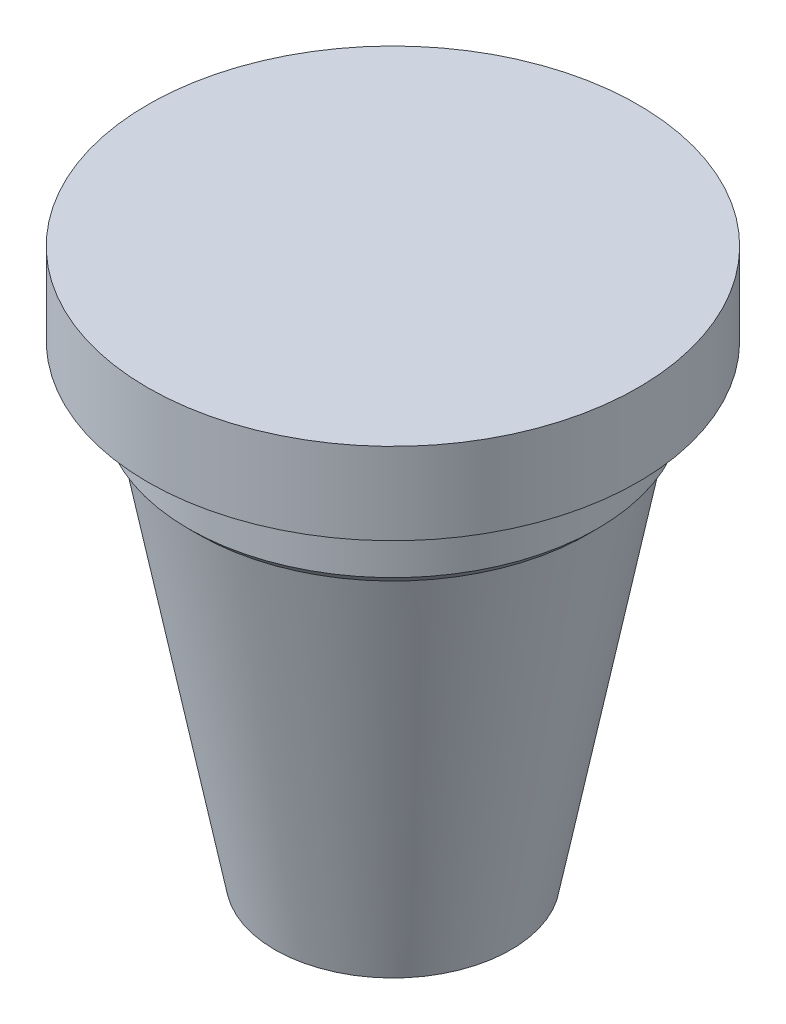
ISO-10303-21;
HEADER;
FILE_DESCRIPTION(('STEP AP214'),'2;1');
FILE_NAME('part.step','',(''),(''),'','','');
FILE_SCHEMA(('AUTOMOTIVE_DESIGN { 1 0 10303 214 1 1 1 1 }'));
ENDSEC;
DATA;
#1=APPLICATION_CONTEXT('core data for automotive mechanical design processes');
#2=APPLICATION_PROTOCOL_DEFINITION('international standard','automotive_design',2000,#1);
#3=PRODUCT_CONTEXT('',#1,'mechanical');
#4=PRODUCT('Part','Part','',(#3));
#5=PRODUCT_RELATED_PRODUCT_CATEGORY('part','',(#4));
#6=PRODUCT_DEFINITION_FORMATION('','',#4);
#7=PRODUCT_DEFINITION_CONTEXT('part definition',#1,'design');
#8=PRODUCT_DEFINITION('design','',#6,#7);
#9=PRODUCT_DEFINITION_SHAPE('','',#8);
#10=(LENGTH_UNIT() NAMED_UNIT(*) SI_UNIT(.MILLI.,.METRE.));
#11=(NAMED_UNIT(*) PLANE_ANGLE_UNIT() SI_UNIT($,.RADIAN.));
#12=(NAMED_UNIT(*) SI_UNIT($,.STERADIAN.) SOLID_ANGLE_UNIT());
#13=UNCERTAINTY_MEASURE_WITH_UNIT(LENGTH_MEASURE(1.E-05),#10,'distance_accuracy_value','');
#14=(GEOMETRIC_REPRESENTATION_CONTEXT(3) GLOBAL_UNCERTAINTY_ASSIGNED_CONTEXT((#13)) GLOBAL_UNIT_ASSIGNED_CONTEXT((#10,
#11,#12)) REPRESENTATION_CONTEXT('',''));
#15=CARTESIAN_POINT('',(0.,0.,0.));
#16=DIRECTION('',(0.,0.,1.));
#17=DIRECTION('',(1.,0.,0.));
#18=AXIS2_PLACEMENT_3D('',#15,#16,#17);
#19=CARTESIAN_POINT('',(0.,2.,0.));
#20=DIRECTION('',(0.,-1.,0.));
#21=DIRECTION('',(0.,0.,-1.));
#22=AXIS2_PLACEMENT_3D('',#19,#20,#21);
#23=PLANE('',#22);
#24=CARTESIAN_POINT('',(0.,2.,0.));
#25=DIRECTION('',(0.,-1.,0.));
#26=DIRECTION('',(0.,0.,-1.));
#27=AXIS2_PLACEMENT_3D('',#24,#25,#26);
#28=CIRCLE('',#27,21.6668554158657);
#29=CARTESIAN_POINT('',(0.,2.,-21.6668554158657));
#30=VERTEX_POINT('',#29);
#31=EDGE_CURVE('E55',#30,#30,#28,.T.);
#32=ORIENTED_EDGE('',*,*,#31,.T.);
#33=EDGE_LOOP('',(#32));
#34=FACE_BOUND('',#33,.T.);
#35=ADVANCED_FACE('F41',(#34),#23,.T.);
#36=CARTESIAN_POINT('',(0.,0.376395142507585,0.));
#37=DIRECTION('',(0.,1.,0.));
#38=DIRECTION('',(0.,0.,1.));
#39=AXIS2_PLACEMENT_3D('',#36,#37,#38);
#40=CONICAL_SURFACE('',#39,21.3557376202002,0.189326600712665);
#41=CARTESIAN_POINT('',(0.,74.9797878302453,0.));
#42=DIRECTION('',(0.,-1.,0.));
#43=DIRECTION('',(0.,0.,-1.));
#44=AXIS2_PLACEMENT_3D('',#41,#42,#43);
#45=CIRCLE('',#44,35.6513607054993);
#46=CARTESIAN_POINT('',(0.,74.9797878302453,-35.6513607054993));
#47=VERTEX_POINT('',#46);
#48=EDGE_CURVE('E49',#47,#47,#45,.T.);
#49=ORIENTED_EDGE('',*,*,#48,.T.);
#50=EDGE_LOOP('',(#49));
#51=FACE_BOUND('',#50,.T.);
#52=ORIENTED_EDGE('',*,*,#31,.F.);
#53=EDGE_LOOP('',(#52));
#54=FACE_BOUND('',#53,.T.);
#55=ADVANCED_FACE('F90',(#51,#54),#40,.T.);
#56=CARTESIAN_POINT('',(0.,75.4142135623731,0.));
#57=DIRECTION('',(0.,1.,0.));
#58=DIRECTION('',(0.,0.,1.));
#59=AXIS2_PLACEMENT_3D('',#56,#57,#58);
#60=CONICAL_SURFACE('',#59,36.0857864376271,0.785398163397447);
#61=CARTESIAN_POINT('',(0.,76.8284271247461,0.));
#62=DIRECTION('',(0.,1.,0.));
#63=DIRECTION('',(0.,0.,1.));
#64=AXIS2_PLACEMENT_3D('',#61,#62,#63);
#65=CIRCLE('',#64,37.5000000000001);
#66=CARTESIAN_POINT('',(0.,76.8284271247461,37.5000000000001));
#67=VERTEX_POINT('',#66);
#68=EDGE_CURVE('E10',#67,#67,#65,.F.);
#69=ORIENTED_EDGE('',*,*,#68,.T.);
#70=EDGE_LOOP('',(#69));
#71=FACE_BOUND('',#70,.T.);
#72=ORIENTED_EDGE('',*,*,#48,.F.);
#73=EDGE_LOOP('',(#72));
#74=FACE_BOUND('',#73,.T.);
#75=ADVANCED_FACE('F97',(#71,#74),#60,.T.);
#76=CARTESIAN_POINT('',(0.,0.,0.));
#77=DIRECTION('',(0.,-1.,0.));
#78=DIRECTION('',(0.,0.,-1.));
#79=AXIS2_PLACEMENT_3D('',#76,#77,#78);
#80=CYLINDRICAL_SURFACE('',#79,37.5000000000001);
#81=ORIENTED_EDGE('',*,*,#68,.F.);
#82=EDGE_LOOP('',(#81));
#83=FACE_BOUND('',#82,.T.);
#84=CARTESIAN_POINT('',(0.,88.,0.));
#85=DIRECTION('',(0.,-1.,0.));
#86=DIRECTION('',(0.,0.,-1.));
#87=AXIS2_PLACEMENT_3D('',#84,#85,#86);
#88=CIRCLE('',#87,37.5000000000001);
#89=CARTESIAN_POINT('',(0.,88.,-37.5000000000001));
#90=VERTEX_POINT('',#89);
#91=EDGE_CURVE('E44',#90,#90,#88,.T.);
#92=ORIENTED_EDGE('',*,*,#91,.T.);
#93=EDGE_LOOP('',(#92));
#94=FACE_BOUND('',#93,.T.);
#95=ADVANCED_FACE('F102',(#83,#94),#80,.T.);
#96=CARTESIAN_POINT('',(0.,103.,0.));
#97=DIRECTION('',(0.,-1.,0.));
#98=DIRECTION('',(0.,0.,-1.));
#99=AXIS2_PLACEMENT_3D('',#96,#97,#98);
#100=CYLINDRICAL_SURFACE('',#99,45.);
#101=CARTESIAN_POINT('',(0.,103.,0.));
#102=DIRECTION('',(0.,1.,0.));
#103=DIRECTION('',(0.,0.,1.));
#104=AXIS2_PLACEMENT_3D('',#101,#102,#103);
#105=CIRCLE('',#104,45.);
#106=CARTESIAN_POINT('',(0.,103.,45.));
#107=VERTEX_POINT('',#106);
#108=EDGE_CURVE('E66',#107,#107,#105,.T.);
#109=ORIENTED_EDGE('',*,*,#108,.F.);
#110=EDGE_LOOP('',(#109));
#111=FACE_BOUND('',#110,.T.);
#112=CARTESIAN_POINT('',(0.,88.,0.));
#113=DIRECTION('',(0.,1.,0.));
#114=DIRECTION('',(0.,0.,1.));
#115=AXIS2_PLACEMENT_3D('',#112,#113,#114);
#116=CIRCLE('',#115,45.);
#117=CARTESIAN_POINT('',(0.,88.,45.));
#118=VERTEX_POINT('',#117);
#119=EDGE_CURVE('E58',#118,#118,#116,.T.);
#120=ORIENTED_EDGE('',*,*,#119,.T.);
#121=EDGE_LOOP('',(#120));
#122=FACE_BOUND('',#121,.T.);
#123=ADVANCED_FACE('F77',(#111,#122),#100,.T.);
#124=CARTESIAN_POINT('',(0.,103.,0.));
#125=DIRECTION('',(0.,1.,0.));
#126=DIRECTION('',(0.,0.,1.));
#127=AXIS2_PLACEMENT_3D('',#124,#125,#126);
#128=PLANE('',#127);
#129=ORIENTED_EDGE('',*,*,#108,.T.);
#130=EDGE_LOOP('',(#129));
#131=FACE_BOUND('',#130,.T.);
#132=ADVANCED_FACE('F81',(#131),#128,.T.);
#133=CARTESIAN_POINT('',(0.,88.,0.));
#134=DIRECTION('',(0.,1.,0.));
#135=DIRECTION('',(0.,0.,1.));
#136=AXIS2_PLACEMENT_3D('',#133,#134,#135);
#137=PLANE('',#136);
#138=ORIENTED_EDGE('',*,*,#91,.F.);
#139=EDGE_LOOP('',(#138));
#140=FACE_BOUND('',#139,.T.);
#141=ORIENTED_EDGE('',*,*,#119,.F.);
#142=EDGE_LOOP('',(#141));
#143=FACE_BOUND('',#142,.T.);
#144=ADVANCED_FACE('F79',(#140,#143),#137,.F.);
#145=CLOSED_SHELL('',(#35,#55,#75,#95,#123,#132,#144));
#146=MANIFOLD_SOLID_BREP('B2',#145);
#147=ADVANCED_BREP_SHAPE_REPRESENTATION('',(#18,#146),#14);
#148=SHAPE_DEFINITION_REPRESENTATION(#9,#147);
ENDSEC;
END-ISO-10303-21;
